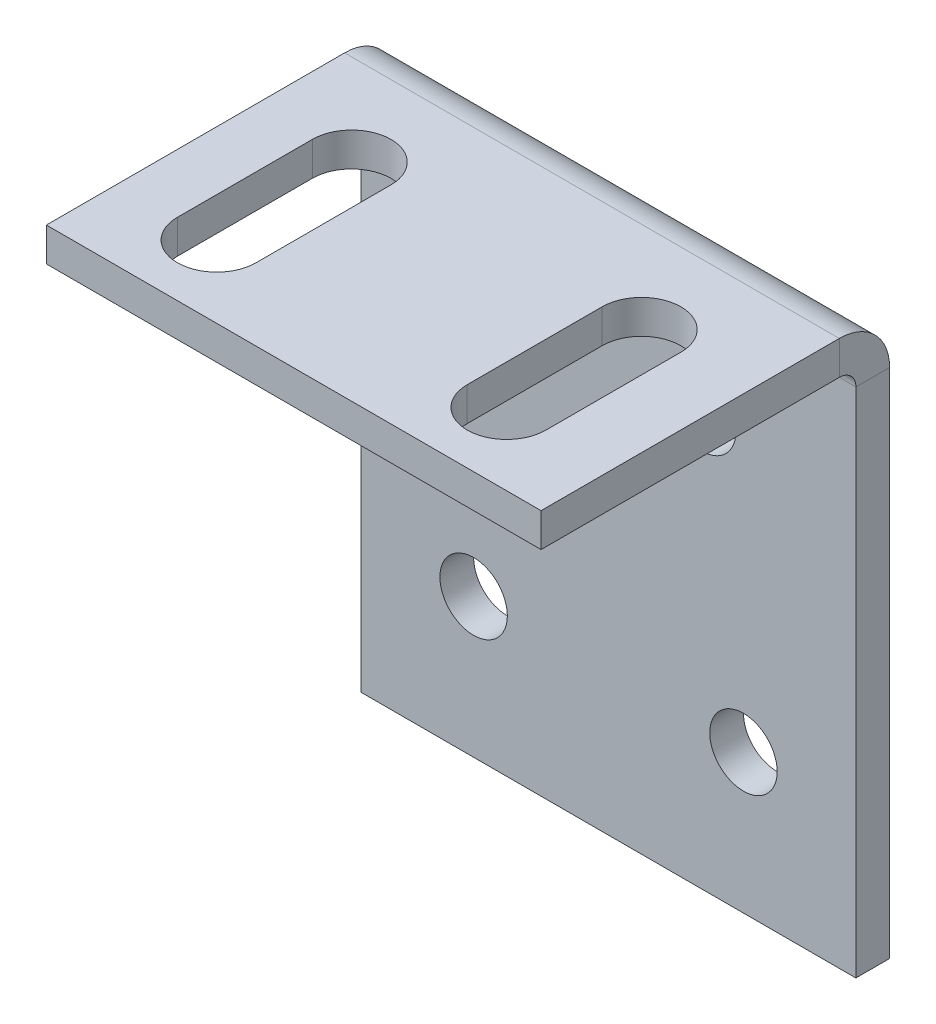
ISO-10303-21;
HEADER;
FILE_DESCRIPTION(('STEP AP214'),'2;1');
FILE_NAME('part.step','',(''),(''),'','','');
FILE_SCHEMA(('AUTOMOTIVE_DESIGN { 1 0 10303 214 1 1 1 1 }'));
ENDSEC;
DATA;
#1=APPLICATION_CONTEXT('core data for automotive mechanical design processes');
#2=APPLICATION_PROTOCOL_DEFINITION('international standard','automotive_design',2000,#1);
#3=PRODUCT_CONTEXT('',#1,'mechanical');
#4=PRODUCT('Part','Part','',(#3));
#5=PRODUCT_RELATED_PRODUCT_CATEGORY('part','',(#4));
#6=PRODUCT_DEFINITION_FORMATION('','',#4);
#7=PRODUCT_DEFINITION_CONTEXT('part definition',#1,'design');
#8=PRODUCT_DEFINITION('design','',#6,#7);
#9=PRODUCT_DEFINITION_SHAPE('','',#8);
#10=(LENGTH_UNIT() NAMED_UNIT(*) SI_UNIT(.MILLI.,.METRE.));
#11=(NAMED_UNIT(*) PLANE_ANGLE_UNIT() SI_UNIT($,.RADIAN.));
#12=(NAMED_UNIT(*) SI_UNIT($,.STERADIAN.) SOLID_ANGLE_UNIT());
#13=UNCERTAINTY_MEASURE_WITH_UNIT(LENGTH_MEASURE(1.E-05),#10,'distance_accuracy_value','');
#14=(GEOMETRIC_REPRESENTATION_CONTEXT(3) GLOBAL_UNCERTAINTY_ASSIGNED_CONTEXT((#13)) GLOBAL_UNIT_ASSIGNED_CONTEXT((#10,
#11,#12)) REPRESENTATION_CONTEXT('',''));
#15=CARTESIAN_POINT('',(0.,0.,0.));
#16=DIRECTION('',(0.,0.,1.));
#17=DIRECTION('',(1.,0.,0.));
#18=AXIS2_PLACEMENT_3D('',#15,#16,#17);
#19=CARTESIAN_POINT('',(-10.1655172413793,4.96896551724138,-1.5));
#20=DIRECTION('',(-1.,0.,0.));
#21=DIRECTION('',(0.,-1.,0.));
#22=AXIS2_PLACEMENT_3D('',#19,#20,#21);
#23=PLANE('',#22);
#24=DIRECTION('',(0.,-1.,0.));
#25=VECTOR('',#24,1.);
#26=CARTESIAN_POINT('',(-10.1655172413793,4.96896551724138,0.));
#27=LINE('',#26,#25);
#28=CARTESIAN_POINT('',(-10.1655172413793,2.73236551724138,0.));
#29=VERTEX_POINT('',#28);
#30=CARTESIAN_POINT('',(-10.1655172413793,-20.0310344827586,0.));
#31=VERTEX_POINT('',#30);
#32=EDGE_CURVE('E291',#29,#31,#27,.T.);
#33=ORIENTED_EDGE('',*,*,#32,.F.);
#34=DIRECTION('',(0.,0.,-1.));
#35=VECTOR('',#34,1.);
#36=CARTESIAN_POINT('',(-10.1655172413793,2.73236551724138,0.));
#37=LINE('',#36,#35);
#38=CARTESIAN_POINT('',(-10.1655172413793,2.73236551724138,-1.5));
#39=VERTEX_POINT('',#38);
#40=EDGE_CURVE('E253',#29,#39,#37,.T.);
#41=ORIENTED_EDGE('',*,*,#40,.T.);
#42=DIRECTION('',(0.,-1.,0.));
#43=VECTOR('',#42,1.);
#44=CARTESIAN_POINT('',(-10.1655172413793,4.96896551724138,-1.5));
#45=LINE('',#44,#43);
#46=CARTESIAN_POINT('',(-10.1655172413793,-20.0310344827586,-1.5));
#47=VERTEX_POINT('',#46);
#48=EDGE_CURVE('E294',#39,#47,#45,.T.);
#49=ORIENTED_EDGE('',*,*,#48,.T.);
#50=DIRECTION('',(0.,0.,1.));
#51=VECTOR('',#50,1.);
#52=CARTESIAN_POINT('',(-10.1655172413793,-20.0310344827586,-1.5));
#53=LINE('',#52,#51);
#54=EDGE_CURVE('E303',#47,#31,#53,.T.);
#55=ORIENTED_EDGE('',*,*,#54,.T.);
#56=EDGE_LOOP('',(#33,#41,#49,#55));
#57=FACE_BOUND('',#56,.T.);
#58=ADVANCED_FACE('F57',(#57),#23,.T.);
#59=CARTESIAN_POINT('',(0.,0.,-1.5));
#60=DIRECTION('',(0.,0.,1.));
#61=DIRECTION('',(1.,0.,0.));
#62=AXIS2_PLACEMENT_3D('',#59,#60,#61);
#63=PLANE('',#62);
#64=CARTESIAN_POINT('',(6.8344827586207,-13.8348292830273,-1.5));
#65=DIRECTION('',(0.,0.,1.));
#66=DIRECTION('',(1.,0.,0.));
#67=AXIS2_PLACEMENT_3D('',#64,#65,#66);
#68=CIRCLE('',#67,1.5);
#69=CARTESIAN_POINT('',(8.3344827586207,-13.8348292830273,-1.5));
#70=VERTEX_POINT('',#69);
#71=EDGE_CURVE('E288',#70,#70,#68,.T.);
#72=ORIENTED_EDGE('',*,*,#71,.T.);
#73=EDGE_LOOP('',(#72));
#74=FACE_BOUND('',#73,.T.);
#75=CARTESIAN_POINT('',(-5.1655172413793,-13.8348292830273,-1.5));
#76=DIRECTION('',(0.,0.,1.));
#77=DIRECTION('',(1.,0.,0.));
#78=AXIS2_PLACEMENT_3D('',#75,#76,#77);
#79=CIRCLE('',#78,1.5);
#80=CARTESIAN_POINT('',(-3.6655172413793,-13.8348292830273,-1.5));
#81=VERTEX_POINT('',#80);
#82=EDGE_CURVE('E282',#81,#81,#79,.T.);
#83=ORIENTED_EDGE('',*,*,#82,.T.);
#84=EDGE_LOOP('',(#83));
#85=FACE_BOUND('',#84,.T.);
#86=CARTESIAN_POINT('',(-3.4155172413793,-1.66280142120456,-1.5));
#87=DIRECTION('',(0.,0.,1.));
#88=DIRECTION('',(1.,0.,0.));
#89=AXIS2_PLACEMENT_3D('',#86,#87,#88);
#90=CIRCLE('',#89,1.5);
#91=CARTESIAN_POINT('',(-1.9155172413793,-1.66280142120456,-1.5));
#92=VERTEX_POINT('',#91);
#93=EDGE_CURVE('E276',#92,#92,#90,.T.);
#94=ORIENTED_EDGE('',*,*,#93,.T.);
#95=EDGE_LOOP('',(#94));
#96=FACE_BOUND('',#95,.T.);
#97=CARTESIAN_POINT('',(4.9944827586207,-1.66280142120456,-1.5));
#98=DIRECTION('',(0.,0.,1.));
#99=DIRECTION('',(1.,0.,0.));
#100=AXIS2_PLACEMENT_3D('',#97,#98,#99);
#101=CIRCLE('',#100,1.5);
#102=CARTESIAN_POINT('',(6.4944827586207,-1.66280142120456,-1.5));
#103=VERTEX_POINT('',#102);
#104=EDGE_CURVE('E270',#103,#103,#101,.T.);
#105=ORIENTED_EDGE('',*,*,#104,.T.);
#106=EDGE_LOOP('',(#105));
#107=FACE_BOUND('',#106,.T.);
#108=DIRECTION('',(-1.,0.,0.));
#109=VECTOR('',#108,1.);
#110=CARTESIAN_POINT('',(-10.1655172413793,2.73236551724138,-1.5));
#111=LINE('',#110,#109);
#112=CARTESIAN_POINT('',(11.8344827586207,2.73236551724139,-1.5));
#113=VERTEX_POINT('',#112);
#114=EDGE_CURVE('E247',#39,#113,#111,.F.);
#115=ORIENTED_EDGE('',*,*,#114,.T.);
#116=DIRECTION('',(0.,1.,0.));
#117=VECTOR('',#116,1.);
#118=CARTESIAN_POINT('',(11.8344827586207,4.96896551724138,-1.5));
#119=LINE('',#118,#117);
#120=CARTESIAN_POINT('',(11.8344827586207,-20.0310344827586,-1.5));
#121=VERTEX_POINT('',#120);
#122=EDGE_CURVE('E300',#121,#113,#119,.T.);
#123=ORIENTED_EDGE('',*,*,#122,.F.);
#124=DIRECTION('',(1.,0.,0.));
#125=VECTOR('',#124,1.);
#126=CARTESIAN_POINT('',(-10.1655172413793,-20.0310344827586,-1.5));
#127=LINE('',#126,#125);
#128=EDGE_CURVE('E296',#47,#121,#127,.T.);
#129=ORIENTED_EDGE('',*,*,#128,.F.);
#130=ORIENTED_EDGE('',*,*,#48,.F.);
#131=EDGE_LOOP('',(#115,#123,#129,#130));
#132=FACE_BOUND('',#131,.T.);
#133=ADVANCED_FACE('F348',(#74,#85,#96,#107,#132),#63,.F.);
#134=CARTESIAN_POINT('',(0.,0.,0.));
#135=DIRECTION('',(0.,0.,1.));
#136=DIRECTION('',(1.,0.,0.));
#137=AXIS2_PLACEMENT_3D('',#134,#135,#136);
#138=PLANE('',#137);
#139=CARTESIAN_POINT('',(4.9944827586207,-1.66280142120456,0.));
#140=DIRECTION('',(0.,0.,1.));
#141=DIRECTION('',(1.,0.,0.));
#142=AXIS2_PLACEMENT_3D('',#139,#140,#141);
#143=CIRCLE('',#142,1.5);
#144=CARTESIAN_POINT('',(6.4944827586207,-1.66280142120456,0.));
#145=VERTEX_POINT('',#144);
#146=EDGE_CURVE('E267',#145,#145,#143,.T.);
#147=ORIENTED_EDGE('',*,*,#146,.F.);
#148=EDGE_LOOP('',(#147));
#149=FACE_BOUND('',#148,.T.);
#150=CARTESIAN_POINT('',(-3.4155172413793,-1.66280142120456,0.));
#151=DIRECTION('',(0.,0.,1.));
#152=DIRECTION('',(1.,0.,0.));
#153=AXIS2_PLACEMENT_3D('',#150,#151,#152);
#154=CIRCLE('',#153,1.5);
#155=CARTESIAN_POINT('',(-1.9155172413793,-1.66280142120456,0.));
#156=VERTEX_POINT('',#155);
#157=EDGE_CURVE('E273',#156,#156,#154,.T.);
#158=ORIENTED_EDGE('',*,*,#157,.F.);
#159=EDGE_LOOP('',(#158));
#160=FACE_BOUND('',#159,.T.);
#161=CARTESIAN_POINT('',(-5.1655172413793,-13.8348292830273,0.));
#162=DIRECTION('',(0.,0.,1.));
#163=DIRECTION('',(1.,0.,0.));
#164=AXIS2_PLACEMENT_3D('',#161,#162,#163);
#165=CIRCLE('',#164,1.5);
#166=CARTESIAN_POINT('',(-3.6655172413793,-13.8348292830273,0.));
#167=VERTEX_POINT('',#166);
#168=EDGE_CURVE('E279',#167,#167,#165,.T.);
#169=ORIENTED_EDGE('',*,*,#168,.F.);
#170=EDGE_LOOP('',(#169));
#171=FACE_BOUND('',#170,.T.);
#172=CARTESIAN_POINT('',(6.8344827586207,-13.8348292830273,0.));
#173=DIRECTION('',(0.,0.,1.));
#174=DIRECTION('',(1.,0.,0.));
#175=AXIS2_PLACEMENT_3D('',#172,#173,#174);
#176=CIRCLE('',#175,1.5);
#177=CARTESIAN_POINT('',(8.3344827586207,-13.8348292830273,0.));
#178=VERTEX_POINT('',#177);
#179=EDGE_CURVE('E285',#178,#178,#176,.T.);
#180=ORIENTED_EDGE('',*,*,#179,.F.);
#181=EDGE_LOOP('',(#180));
#182=FACE_BOUND('',#181,.T.);
#183=DIRECTION('',(0.,1.,0.));
#184=VECTOR('',#183,1.);
#185=CARTESIAN_POINT('',(11.8344827586207,4.96896551724138,0.));
#186=LINE('',#185,#184);
#187=CARTESIAN_POINT('',(11.8344827586207,-20.0310344827586,0.));
#188=VERTEX_POINT('',#187);
#189=CARTESIAN_POINT('',(11.8344827586207,2.73236551724138,0.));
#190=VERTEX_POINT('',#189);
#191=EDGE_CURVE('E297',#188,#190,#186,.T.);
#192=ORIENTED_EDGE('',*,*,#191,.T.);
#193=DIRECTION('',(-1.,0.,0.));
#194=VECTOR('',#193,1.);
#195=CARTESIAN_POINT('',(-10.1655172413793,2.73236551724138,0.));
#196=LINE('',#195,#194);
#197=EDGE_CURVE('E259',#29,#190,#196,.F.);
#198=ORIENTED_EDGE('',*,*,#197,.F.);
#199=ORIENTED_EDGE('',*,*,#32,.T.);
#200=DIRECTION('',(1.,0.,0.));
#201=VECTOR('',#200,1.);
#202=CARTESIAN_POINT('',(-10.1655172413793,-20.0310344827586,0.));
#203=LINE('',#202,#201);
#204=EDGE_CURVE('E305',#31,#188,#203,.T.);
#205=ORIENTED_EDGE('',*,*,#204,.T.);
#206=EDGE_LOOP('',(#192,#198,#199,#205));
#207=FACE_BOUND('',#206,.T.);
#208=ADVANCED_FACE('F353',(#149,#160,#171,#182,#207),#138,.T.);
#209=CARTESIAN_POINT('',(11.8344827586207,4.96896551724138,-1.5));
#210=DIRECTION('',(1.,0.,0.));
#211=DIRECTION('',(0.,1.,0.));
#212=AXIS2_PLACEMENT_3D('',#209,#210,#211);
#213=PLANE('',#212);
#214=DIRECTION('',(0.,0.,-1.));
#215=VECTOR('',#214,1.);
#216=CARTESIAN_POINT('',(11.8344827586207,2.73236551724138,0.));
#217=LINE('',#216,#215);
#218=EDGE_CURVE('E264',#190,#113,#217,.T.);
#219=ORIENTED_EDGE('',*,*,#218,.F.);
#220=ORIENTED_EDGE('',*,*,#191,.F.);
#221=DIRECTION('',(0.,0.,1.));
#222=VECTOR('',#221,1.);
#223=CARTESIAN_POINT('',(11.8344827586207,-20.0310344827586,-1.5));
#224=LINE('',#223,#222);
#225=EDGE_CURVE('E310',#121,#188,#224,.T.);
#226=ORIENTED_EDGE('',*,*,#225,.F.);
#227=ORIENTED_EDGE('',*,*,#122,.T.);
#228=EDGE_LOOP('',(#219,#220,#226,#227));
#229=FACE_BOUND('',#228,.T.);
#230=ADVANCED_FACE('F394',(#229),#213,.T.);
#231=CARTESIAN_POINT('',(-10.1655172413793,-20.0310344827586,-1.5));
#232=DIRECTION('',(0.,-1.,0.));
#233=DIRECTION('',(0.,0.,-1.));
#234=AXIS2_PLACEMENT_3D('',#231,#232,#233);
#235=PLANE('',#234);
#236=ORIENTED_EDGE('',*,*,#204,.F.);
#237=ORIENTED_EDGE('',*,*,#54,.F.);
#238=ORIENTED_EDGE('',*,*,#128,.T.);
#239=ORIENTED_EDGE('',*,*,#225,.T.);
#240=EDGE_LOOP('',(#236,#237,#238,#239));
#241=FACE_BOUND('',#240,.T.);
#242=ADVANCED_FACE('F397',(#241),#235,.T.);
#243=CARTESIAN_POINT('',(6.8344827586207,-13.8348292830273,-1.5));
#244=DIRECTION('',(0.,0.,1.));
#245=DIRECTION('',(1.,0.,0.));
#246=AXIS2_PLACEMENT_3D('',#243,#244,#245);
#247=CYLINDRICAL_SURFACE('',#246,1.5);
#248=ORIENTED_EDGE('',*,*,#71,.F.);
#249=EDGE_LOOP('',(#248));
#250=FACE_BOUND('',#249,.T.);
#251=ORIENTED_EDGE('',*,*,#179,.T.);
#252=EDGE_LOOP('',(#251));
#253=FACE_BOUND('',#252,.T.);
#254=ADVANCED_FACE('F401',(#250,#253),#247,.F.);
#255=CARTESIAN_POINT('',(-5.1655172413793,-13.8348292830273,-1.5));
#256=DIRECTION('',(0.,0.,1.));
#257=DIRECTION('',(1.,0.,0.));
#258=AXIS2_PLACEMENT_3D('',#255,#256,#257);
#259=CYLINDRICAL_SURFACE('',#258,1.5);
#260=ORIENTED_EDGE('',*,*,#82,.F.);
#261=EDGE_LOOP('',(#260));
#262=FACE_BOUND('',#261,.T.);
#263=ORIENTED_EDGE('',*,*,#168,.T.);
#264=EDGE_LOOP('',(#263));
#265=FACE_BOUND('',#264,.T.);
#266=ADVANCED_FACE('F406',(#262,#265),#259,.F.);
#267=CARTESIAN_POINT('',(-3.4155172413793,-1.66280142120456,-1.5));
#268=DIRECTION('',(0.,0.,1.));
#269=DIRECTION('',(1.,0.,0.));
#270=AXIS2_PLACEMENT_3D('',#267,#268,#269);
#271=CYLINDRICAL_SURFACE('',#270,1.5);
#272=ORIENTED_EDGE('',*,*,#93,.F.);
#273=EDGE_LOOP('',(#272));
#274=FACE_BOUND('',#273,.T.);
#275=ORIENTED_EDGE('',*,*,#157,.T.);
#276=EDGE_LOOP('',(#275));
#277=FACE_BOUND('',#276,.T.);
#278=ADVANCED_FACE('F416',(#274,#277),#271,.F.);
#279=CARTESIAN_POINT('',(4.9944827586207,-1.66280142120456,-1.5));
#280=DIRECTION('',(0.,0.,1.));
#281=DIRECTION('',(1.,0.,0.));
#282=AXIS2_PLACEMENT_3D('',#279,#280,#281);
#283=CYLINDRICAL_SURFACE('',#282,1.5);
#284=ORIENTED_EDGE('',*,*,#104,.F.);
#285=EDGE_LOOP('',(#284));
#286=FACE_BOUND('',#285,.T.);
#287=ORIENTED_EDGE('',*,*,#146,.T.);
#288=EDGE_LOOP('',(#287));
#289=FACE_BOUND('',#288,.T.);
#290=ADVANCED_FACE('F420',(#286,#289),#283,.F.);
#291=CARTESIAN_POINT('',(11.8344827586207,2.73236551724138,0.7366));
#292=DIRECTION('',(1.,0.,0.));
#293=DIRECTION('',(0.,0.,-1.));
#294=AXIS2_PLACEMENT_3D('',#291,#292,#293);
#295=PLANE('',#294);
#296=DIRECTION('',(0.,-1.,0.));
#297=VECTOR('',#296,1.);
#298=CARTESIAN_POINT('',(11.8344827586207,4.96896551724138,0.736599999999992));
#299=LINE('',#298,#297);
#300=CARTESIAN_POINT('',(11.8344827586207,3.46896551724138,0.736599999999997));
#301=VERTEX_POINT('',#300);
#302=CARTESIAN_POINT('',(11.8344827586207,4.96896551724138,0.736599999999992));
#303=VERTEX_POINT('',#302);
#304=EDGE_CURVE('E210',#301,#303,#299,.F.);
#305=ORIENTED_EDGE('',*,*,#304,.F.);
#306=CARTESIAN_POINT('',(11.8344827586207,2.73236551724138,0.7366));
#307=DIRECTION('',(-1.,0.,0.));
#308=DIRECTION('',(0.,0.,1.));
#309=AXIS2_PLACEMENT_3D('',#306,#307,#308);
#310=CIRCLE('',#309,0.7366);
#311=EDGE_CURVE('E256',#190,#301,#310,.F.);
#312=ORIENTED_EDGE('',*,*,#311,.F.);
#313=ORIENTED_EDGE('',*,*,#218,.T.);
#314=CARTESIAN_POINT('',(11.8344827586207,2.73236551724138,0.7366));
#315=DIRECTION('',(-1.,0.,0.));
#316=DIRECTION('',(0.,0.,1.));
#317=AXIS2_PLACEMENT_3D('',#314,#315,#316);
#318=CIRCLE('',#317,2.2366);
#319=EDGE_CURVE('E249',#113,#303,#318,.F.);
#320=ORIENTED_EDGE('',*,*,#319,.T.);
#321=EDGE_LOOP('',(#305,#312,#313,#320));
#322=FACE_BOUND('',#321,.T.);
#323=ADVANCED_FACE('F391',(#322),#295,.T.);
#324=CARTESIAN_POINT('',(-10.1655172413793,2.73236551724138,0.736600000000001));
#325=DIRECTION('',(1.,0.,0.));
#326=DIRECTION('',(0.,0.,-1.));
#327=AXIS2_PLACEMENT_3D('',#324,#325,#326);
#328=PLANE('',#327);
#329=CARTESIAN_POINT('',(-10.1655172413793,2.73236551724138,0.736600000000001));
#330=DIRECTION('',(-1.,0.,0.));
#331=DIRECTION('',(0.,0.,1.));
#332=AXIS2_PLACEMENT_3D('',#329,#330,#331);
#333=CIRCLE('',#332,0.7366);
#334=CARTESIAN_POINT('',(-10.1655172413793,3.46896551724138,0.736599999999999));
#335=VERTEX_POINT('',#334);
#336=EDGE_CURVE('E220',#335,#29,#333,.T.);
#337=ORIENTED_EDGE('',*,*,#336,.F.);
#338=DIRECTION('',(0.,-1.,0.));
#339=VECTOR('',#338,1.);
#340=CARTESIAN_POINT('',(-10.1655172413793,3.46896551724138,0.736599999999999));
#341=LINE('',#340,#339);
#342=CARTESIAN_POINT('',(-10.1655172413793,4.96896551724138,0.736599999999993));
#343=VERTEX_POINT('',#342);
#344=EDGE_CURVE('E240',#335,#343,#341,.F.);
#345=ORIENTED_EDGE('',*,*,#344,.T.);
#346=CARTESIAN_POINT('',(-10.1655172413793,2.73236551724138,0.736600000000001));
#347=DIRECTION('',(-1.,0.,0.));
#348=DIRECTION('',(0.,0.,1.));
#349=AXIS2_PLACEMENT_3D('',#346,#347,#348);
#350=CIRCLE('',#349,2.2366);
#351=EDGE_CURVE('E250',#343,#39,#350,.T.);
#352=ORIENTED_EDGE('',*,*,#351,.T.);
#353=ORIENTED_EDGE('',*,*,#40,.F.);
#354=EDGE_LOOP('',(#337,#345,#352,#353));
#355=FACE_BOUND('',#354,.T.);
#356=ADVANCED_FACE('F364',(#355),#328,.F.);
#357=CARTESIAN_POINT('',(-10.1655172413793,2.73236551724138,0.736600000000001));
#358=DIRECTION('',(-1.,0.,0.));
#359=DIRECTION('',(0.,1.,0.));
#360=AXIS2_PLACEMENT_3D('',#357,#358,#359);
#361=CYLINDRICAL_SURFACE('',#360,2.2366);
#362=ORIENTED_EDGE('',*,*,#114,.F.);
#363=ORIENTED_EDGE('',*,*,#351,.F.);
#364=DIRECTION('',(-1.,0.,0.));
#365=VECTOR('',#364,1.);
#366=CARTESIAN_POINT('',(11.8344827586207,4.96896551724138,0.736599999999992));
#367=LINE('',#366,#365);
#368=EDGE_CURVE('E238',#343,#303,#367,.F.);
#369=ORIENTED_EDGE('',*,*,#368,.T.);
#370=ORIENTED_EDGE('',*,*,#319,.F.);
#371=EDGE_LOOP('',(#362,#363,#369,#370));
#372=FACE_BOUND('',#371,.T.);
#373=ADVANCED_FACE('F389',(#372),#361,.T.);
#374=CARTESIAN_POINT('',(-10.1655172413793,2.73236551724138,0.736600000000001));
#375=DIRECTION('',(-1.,0.,0.));
#376=DIRECTION('',(0.,1.,0.));
#377=AXIS2_PLACEMENT_3D('',#374,#375,#376);
#378=CYLINDRICAL_SURFACE('',#377,0.7366);
#379=ORIENTED_EDGE('',*,*,#197,.T.);
#380=ORIENTED_EDGE('',*,*,#311,.T.);
#381=DIRECTION('',(-1.,0.,0.));
#382=VECTOR('',#381,1.);
#383=CARTESIAN_POINT('',(11.8344827586207,3.46896551724138,0.736599999999997));
#384=LINE('',#383,#382);
#385=EDGE_CURVE('E243',#301,#335,#384,.T.);
#386=ORIENTED_EDGE('',*,*,#385,.T.);
#387=ORIENTED_EDGE('',*,*,#336,.T.);
#388=EDGE_LOOP('',(#379,#380,#386,#387));
#389=FACE_BOUND('',#388,.T.);
#390=ADVANCED_FACE('F367',(#389),#378,.F.);
#391=CARTESIAN_POINT('',(11.8344827586207,4.96896551724138,0.));
#392=DIRECTION('',(-1.,0.,0.));
#393=DIRECTION('',(0.,0.,1.));
#394=AXIS2_PLACEMENT_3D('',#391,#392,#393);
#395=PLANE('',#394);
#396=ORIENTED_EDGE('',*,*,#304,.T.);
#397=DIRECTION('',(0.,0.,-1.));
#398=VECTOR('',#397,1.);
#399=CARTESIAN_POINT('',(11.8344827586207,4.96896551724138,0.));
#400=LINE('',#399,#398);
#401=CARTESIAN_POINT('',(11.8344827586207,4.96896551724143,14.));
#402=VERTEX_POINT('',#401);
#403=EDGE_CURVE('E228',#402,#303,#400,.T.);
#404=ORIENTED_EDGE('',*,*,#403,.F.);
#405=DIRECTION('',(0.,-1.,0.));
#406=VECTOR('',#405,1.);
#407=CARTESIAN_POINT('',(11.8344827586207,4.96896551724143,14.));
#408=LINE('',#407,#406);
#409=CARTESIAN_POINT('',(11.8344827586207,3.46896551724143,14.));
#410=VERTEX_POINT('',#409);
#411=EDGE_CURVE('E221',#402,#410,#408,.T.);
#412=ORIENTED_EDGE('',*,*,#411,.T.);
#413=DIRECTION('',(0.,0.,1.));
#414=VECTOR('',#413,1.);
#415=CARTESIAN_POINT('',(11.8344827586207,3.46896551724138,0.));
#416=LINE('',#415,#414);
#417=EDGE_CURVE('E235',#410,#301,#416,.F.);
#418=ORIENTED_EDGE('',*,*,#417,.T.);
#419=EDGE_LOOP('',(#396,#404,#412,#418));
#420=FACE_BOUND('',#419,.T.);
#421=ADVANCED_FACE('F375',(#420),#395,.F.);
#422=CARTESIAN_POINT('',(-10.1655172413793,4.96896551724143,14.));
#423=DIRECTION('',(1.,0.,0.));
#424=DIRECTION('',(0.,0.,-1.));
#425=AXIS2_PLACEMENT_3D('',#422,#423,#424);
#426=PLANE('',#425);
#427=ORIENTED_EDGE('',*,*,#344,.F.);
#428=DIRECTION('',(0.,0.,-1.));
#429=VECTOR('',#428,1.);
#430=CARTESIAN_POINT('',(-10.1655172413793,3.46896551724143,14.));
#431=LINE('',#430,#429);
#432=CARTESIAN_POINT('',(-10.1655172413793,3.46896551724143,14.));
#433=VERTEX_POINT('',#432);
#434=EDGE_CURVE('E233',#335,#433,#431,.F.);
#435=ORIENTED_EDGE('',*,*,#434,.T.);
#436=DIRECTION('',(0.,-1.,0.));
#437=VECTOR('',#436,1.);
#438=CARTESIAN_POINT('',(-10.1655172413793,4.96896551724143,14.));
#439=LINE('',#438,#437);
#440=CARTESIAN_POINT('',(-10.1655172413793,4.96896551724143,14.));
#441=VERTEX_POINT('',#440);
#442=EDGE_CURVE('E217',#441,#433,#439,.T.);
#443=ORIENTED_EDGE('',*,*,#442,.F.);
#444=DIRECTION('',(0.,0.,1.));
#445=VECTOR('',#444,1.);
#446=CARTESIAN_POINT('',(-10.1655172413793,4.96896551724138,0.));
#447=LINE('',#446,#445);
#448=EDGE_CURVE('E226',#343,#441,#447,.T.);
#449=ORIENTED_EDGE('',*,*,#448,.F.);
#450=EDGE_LOOP('',(#427,#435,#443,#449));
#451=FACE_BOUND('',#450,.T.);
#452=ADVANCED_FACE('F384',(#451),#426,.F.);
#453=CARTESIAN_POINT('',(0.,4.96896551724138,0.));
#454=DIRECTION('',(0.,-1.,0.));
#455=DIRECTION('',(0.,0.,-1.));
#456=AXIS2_PLACEMENT_3D('',#453,#454,#455);
#457=PLANE('',#456);
#458=DIRECTION('',(0.,0.,-1.));
#459=VECTOR('',#458,1.);
#460=CARTESIAN_POINT('',(8.84053100399615,4.96896551724142,10.7894952077032));
#461=LINE('',#460,#459);
#462=CARTESIAN_POINT('',(8.84053100399615,4.96896551724142,10.7894952077032));
#463=VERTEX_POINT('',#462);
#464=CARTESIAN_POINT('',(8.84053100399615,4.9689655172414,4.78949520770321));
#465=VERTEX_POINT('',#464);
#466=EDGE_CURVE('E180',#463,#465,#461,.T.);
#467=ORIENTED_EDGE('',*,*,#466,.F.);
#468=CARTESIAN_POINT('',(7.09053100399615,4.96896551724142,10.7894952077032));
#469=DIRECTION('',(0.,1.,0.));
#470=DIRECTION('',(0.,0.,1.));
#471=AXIS2_PLACEMENT_3D('',#468,#469,#470);
#472=CIRCLE('',#471,1.75);
#473=CARTESIAN_POINT('',(5.34053100399615,4.96896551724142,10.7894952077032));
#474=VERTEX_POINT('',#473);
#475=EDGE_CURVE('E71',#474,#463,#472,.T.);
#476=ORIENTED_EDGE('',*,*,#475,.F.);
#477=DIRECTION('',(0.,0.,1.));
#478=VECTOR('',#477,1.);
#479=CARTESIAN_POINT('',(5.34053100399615,4.96896551724142,10.7894952077032));
#480=LINE('',#479,#478);
#481=CARTESIAN_POINT('',(5.34053100399615,4.9689655172414,4.78949520770321));
#482=VERTEX_POINT('',#481);
#483=EDGE_CURVE('E187',#482,#474,#480,.T.);
#484=ORIENTED_EDGE('',*,*,#483,.F.);
#485=CARTESIAN_POINT('',(7.09053100399615,4.9689655172414,4.78949520770321));
#486=DIRECTION('',(0.,1.,0.));
#487=DIRECTION('',(0.,0.,1.));
#488=AXIS2_PLACEMENT_3D('',#485,#486,#487);
#489=CIRCLE('',#488,1.75);
#490=EDGE_CURVE('E171',#465,#482,#489,.T.);
#491=ORIENTED_EDGE('',*,*,#490,.F.);
#492=EDGE_LOOP('',(#467,#476,#484,#491));
#493=FACE_BOUND('',#492,.T.);
#494=DIRECTION('',(0.,0.,-1.));
#495=VECTOR('',#494,1.);
#496=CARTESIAN_POINT('',(-4.05074512829754,4.96896551724142,10.7894952077032));
#497=LINE('',#496,#495);
#498=CARTESIAN_POINT('',(-4.05074512829754,4.96896551724142,10.7894952077032));
#499=VERTEX_POINT('',#498);
#500=CARTESIAN_POINT('',(-4.05074512829754,4.9689655172414,4.78949520770321));
#501=VERTEX_POINT('',#500);
#502=EDGE_CURVE('E198',#499,#501,#497,.T.);
#503=ORIENTED_EDGE('',*,*,#502,.F.);
#504=CARTESIAN_POINT('',(-5.80074512829754,4.96896551724142,10.7894952077032));
#505=DIRECTION('',(0.,1.,0.));
#506=DIRECTION('',(0.,0.,1.));
#507=AXIS2_PLACEMENT_3D('',#504,#505,#506);
#508=CIRCLE('',#507,1.75);
#509=CARTESIAN_POINT('',(-7.55074512829754,4.96896551724142,10.7894952077032));
#510=VERTEX_POINT('',#509);
#511=EDGE_CURVE('E194',#510,#499,#508,.T.);
#512=ORIENTED_EDGE('',*,*,#511,.F.);
#513=DIRECTION('',(0.,0.,1.));
#514=VECTOR('',#513,1.);
#515=CARTESIAN_POINT('',(-7.55074512829754,4.96896551724142,10.7894952077032));
#516=LINE('',#515,#514);
#517=CARTESIAN_POINT('',(-7.55074512829754,4.9689655172414,4.78949520770321));
#518=VERTEX_POINT('',#517);
#519=EDGE_CURVE('E204',#518,#510,#516,.T.);
#520=ORIENTED_EDGE('',*,*,#519,.F.);
#521=CARTESIAN_POINT('',(-5.80074512829754,4.9689655172414,4.78949520770321));
#522=DIRECTION('',(0.,1.,0.));
#523=DIRECTION('',(0.,0.,1.));
#524=AXIS2_PLACEMENT_3D('',#521,#522,#523);
#525=CIRCLE('',#524,1.75);
#526=EDGE_CURVE('E201',#501,#518,#525,.T.);
#527=ORIENTED_EDGE('',*,*,#526,.F.);
#528=EDGE_LOOP('',(#503,#512,#520,#527));
#529=FACE_BOUND('',#528,.T.);
#530=ORIENTED_EDGE('',*,*,#368,.F.);
#531=ORIENTED_EDGE('',*,*,#448,.T.);
#532=DIRECTION('',(1.,0.,0.));
#533=VECTOR('',#532,1.);
#534=CARTESIAN_POINT('',(0.,4.96896551724143,14.));
#535=LINE('',#534,#533);
#536=EDGE_CURVE('E224',#441,#402,#535,.T.);
#537=ORIENTED_EDGE('',*,*,#536,.T.);
#538=ORIENTED_EDGE('',*,*,#403,.T.);
#539=EDGE_LOOP('',(#530,#531,#537,#538));
#540=FACE_BOUND('',#539,.T.);
#541=ADVANCED_FACE('F184',(#493,#529,#540),#457,.F.);
#542=CARTESIAN_POINT('',(0.,3.46896551724138,0.));
#543=DIRECTION('',(0.,-1.,0.));
#544=DIRECTION('',(0.,0.,-1.));
#545=AXIS2_PLACEMENT_3D('',#542,#543,#544);
#546=PLANE('',#545);
#547=CARTESIAN_POINT('',(7.09053100399615,3.46896551724142,10.7894952077032));
#548=DIRECTION('',(0.,-1.,0.));
#549=DIRECTION('',(0.,0.,-1.));
#550=AXIS2_PLACEMENT_3D('',#547,#548,#549);
#551=CIRCLE('',#550,1.75);
#552=CARTESIAN_POINT('',(8.84053100399615,3.46896551724141,10.7894952077032));
#553=VERTEX_POINT('',#552);
#554=CARTESIAN_POINT('',(5.34053100399615,3.46896551724141,10.7894952077032));
#555=VERTEX_POINT('',#554);
#556=EDGE_CURVE('E13',#553,#555,#551,.T.);
#557=ORIENTED_EDGE('',*,*,#556,.F.);
#558=DIRECTION('',(0.,0.,1.));
#559=VECTOR('',#558,1.);
#560=CARTESIAN_POINT('',(8.84053100399615,3.46896551724138,0.));
#561=LINE('',#560,#559);
#562=CARTESIAN_POINT('',(8.84053100399615,3.4689655172414,4.78949520770321));
#563=VERTEX_POINT('',#562);
#564=EDGE_CURVE('E323',#563,#553,#561,.T.);
#565=ORIENTED_EDGE('',*,*,#564,.F.);
#566=CARTESIAN_POINT('',(7.09053100399615,3.4689655172414,4.78949520770321));
#567=DIRECTION('',(0.,-1.,0.));
#568=DIRECTION('',(0.,0.,-1.));
#569=AXIS2_PLACEMENT_3D('',#566,#567,#568);
#570=CIRCLE('',#569,1.75);
#571=CARTESIAN_POINT('',(5.34053100399615,3.46896551724139,4.78949520770321));
#572=VERTEX_POINT('',#571);
#573=EDGE_CURVE('E174',#572,#563,#570,.T.);
#574=ORIENTED_EDGE('',*,*,#573,.F.);
#575=DIRECTION('',(0.,0.,-1.));
#576=VECTOR('',#575,1.);
#577=CARTESIAN_POINT('',(5.34053100399615,3.46896551724138,0.));
#578=LINE('',#577,#576);
#579=EDGE_CURVE('E64',#555,#572,#578,.T.);
#580=ORIENTED_EDGE('',*,*,#579,.F.);
#581=EDGE_LOOP('',(#557,#565,#574,#580));
#582=FACE_BOUND('',#581,.T.);
#583=CARTESIAN_POINT('',(-5.80074512829754,3.46896551724142,10.7894952077032));
#584=DIRECTION('',(0.,-1.,0.));
#585=DIRECTION('',(0.,0.,-1.));
#586=AXIS2_PLACEMENT_3D('',#583,#584,#585);
#587=CIRCLE('',#586,1.75);
#588=CARTESIAN_POINT('',(-4.05074512829754,3.46896551724141,10.7894952077032));
#589=VERTEX_POINT('',#588);
#590=CARTESIAN_POINT('',(-7.55074512829754,3.46896551724141,10.7894952077032));
#591=VERTEX_POINT('',#590);
#592=EDGE_CURVE('E321',#589,#591,#587,.T.);
#593=ORIENTED_EDGE('',*,*,#592,.F.);
#594=DIRECTION('',(0.,0.,1.));
#595=VECTOR('',#594,1.);
#596=CARTESIAN_POINT('',(-4.05074512829754,3.46896551724138,0.));
#597=LINE('',#596,#595);
#598=CARTESIAN_POINT('',(-4.05074512829754,3.4689655172414,4.78949520770321));
#599=VERTEX_POINT('',#598);
#600=EDGE_CURVE('E312',#599,#589,#597,.T.);
#601=ORIENTED_EDGE('',*,*,#600,.F.);
#602=CARTESIAN_POINT('',(-5.80074512829754,3.4689655172414,4.78949520770321));
#603=DIRECTION('',(0.,-1.,0.));
#604=DIRECTION('',(0.,0.,-1.));
#605=AXIS2_PLACEMENT_3D('',#602,#603,#604);
#606=CIRCLE('',#605,1.75);
#607=CARTESIAN_POINT('',(-7.55074512829754,3.46896551724139,4.78949520770321));
#608=VERTEX_POINT('',#607);
#609=EDGE_CURVE('E316',#608,#599,#606,.T.);
#610=ORIENTED_EDGE('',*,*,#609,.F.);
#611=DIRECTION('',(0.,0.,-1.));
#612=VECTOR('',#611,1.);
#613=CARTESIAN_POINT('',(-7.55074512829754,3.46896551724138,0.));
#614=LINE('',#613,#612);
#615=EDGE_CURVE('E319',#591,#608,#614,.T.);
#616=ORIENTED_EDGE('',*,*,#615,.F.);
#617=EDGE_LOOP('',(#593,#601,#610,#616));
#618=FACE_BOUND('',#617,.T.);
#619=ORIENTED_EDGE('',*,*,#434,.F.);
#620=ORIENTED_EDGE('',*,*,#385,.F.);
#621=ORIENTED_EDGE('',*,*,#417,.F.);
#622=DIRECTION('',(-1.,0.,0.));
#623=VECTOR('',#622,1.);
#624=CARTESIAN_POINT('',(11.8344827586207,3.46896551724143,14.));
#625=LINE('',#624,#623);
#626=EDGE_CURVE('E231',#433,#410,#625,.F.);
#627=ORIENTED_EDGE('',*,*,#626,.F.);
#628=EDGE_LOOP('',(#619,#620,#621,#627));
#629=FACE_BOUND('',#628,.T.);
#630=ADVANCED_FACE('F331',(#582,#618,#629),#546,.T.);
#631=CARTESIAN_POINT('',(11.8344827586207,4.96896551724143,14.));
#632=DIRECTION('',(0.,0.,-1.));
#633=DIRECTION('',(0.,1.,0.));
#634=AXIS2_PLACEMENT_3D('',#631,#632,#633);
#635=PLANE('',#634);
#636=ORIENTED_EDGE('',*,*,#626,.T.);
#637=ORIENTED_EDGE('',*,*,#411,.F.);
#638=ORIENTED_EDGE('',*,*,#536,.F.);
#639=ORIENTED_EDGE('',*,*,#442,.T.);
#640=EDGE_LOOP('',(#636,#637,#638,#639));
#641=FACE_BOUND('',#640,.T.);
#642=ADVANCED_FACE('F380',(#641),#635,.F.);
#643=CARTESIAN_POINT('',(-5.80074512829754,-5.03103448275858,10.7894952077032));
#644=DIRECTION('',(0.,1.,0.));
#645=DIRECTION('',(0.,0.,1.));
#646=AXIS2_PLACEMENT_3D('',#643,#644,#645);
#647=CYLINDRICAL_SURFACE('',#646,1.75);
#648=ORIENTED_EDGE('',*,*,#592,.T.);
#649=DIRECTION('',(0.,1.,0.));
#650=VECTOR('',#649,1.);
#651=CARTESIAN_POINT('',(-7.55074512829754,-5.03103448275858,10.7894952077032));
#652=LINE('',#651,#650);
#653=EDGE_CURVE('E208',#591,#510,#652,.T.);
#654=ORIENTED_EDGE('',*,*,#653,.T.);
#655=ORIENTED_EDGE('',*,*,#511,.T.);
#656=DIRECTION('',(0.,1.,0.));
#657=VECTOR('',#656,1.);
#658=CARTESIAN_POINT('',(-4.05074512829754,-5.03103448275858,10.7894952077032));
#659=LINE('',#658,#657);
#660=EDGE_CURVE('E207',#589,#499,#659,.T.);
#661=ORIENTED_EDGE('',*,*,#660,.F.);
#662=EDGE_LOOP('',(#648,#654,#655,#661));
#663=FACE_BOUND('',#662,.T.);
#664=ADVANCED_FACE('F439',(#663),#647,.F.);
#665=CARTESIAN_POINT('',(-7.55074512829754,-5.03103448275858,10.7894952077032));
#666=DIRECTION('',(-1.,0.,0.));
#667=DIRECTION('',(0.,0.,1.));
#668=AXIS2_PLACEMENT_3D('',#665,#666,#667);
#669=PLANE('',#668);
#670=ORIENTED_EDGE('',*,*,#615,.T.);
#671=DIRECTION('',(0.,1.,0.));
#672=VECTOR('',#671,1.);
#673=CARTESIAN_POINT('',(-7.55074512829754,-5.0310344827586,4.78949520770324));
#674=LINE('',#673,#672);
#675=EDGE_CURVE('E211',#608,#518,#674,.T.);
#676=ORIENTED_EDGE('',*,*,#675,.T.);
#677=ORIENTED_EDGE('',*,*,#519,.T.);
#678=ORIENTED_EDGE('',*,*,#653,.F.);
#679=EDGE_LOOP('',(#670,#676,#677,#678));
#680=FACE_BOUND('',#679,.T.);
#681=ADVANCED_FACE('F445',(#680),#669,.F.);
#682=CARTESIAN_POINT('',(-5.80074512829754,-5.0310344827586,4.78949520770324));
#683=DIRECTION('',(0.,1.,0.));
#684=DIRECTION('',(0.,0.,1.));
#685=AXIS2_PLACEMENT_3D('',#682,#683,#684);
#686=CYLINDRICAL_SURFACE('',#685,1.75);
#687=ORIENTED_EDGE('',*,*,#609,.T.);
#688=DIRECTION('',(0.,1.,0.));
#689=VECTOR('',#688,1.);
#690=CARTESIAN_POINT('',(-4.05074512829754,-5.0310344827586,4.78949520770324));
#691=LINE('',#690,#689);
#692=EDGE_CURVE('E213',#599,#501,#691,.T.);
#693=ORIENTED_EDGE('',*,*,#692,.T.);
#694=ORIENTED_EDGE('',*,*,#526,.T.);
#695=ORIENTED_EDGE('',*,*,#675,.F.);
#696=EDGE_LOOP('',(#687,#693,#694,#695));
#697=FACE_BOUND('',#696,.T.);
#698=ADVANCED_FACE('F342',(#697),#686,.F.);
#699=CARTESIAN_POINT('',(-4.05074512829754,-5.03103448275858,10.7894952077032));
#700=DIRECTION('',(1.,0.,0.));
#701=DIRECTION('',(0.,0.,-1.));
#702=AXIS2_PLACEMENT_3D('',#699,#700,#701);
#703=PLANE('',#702);
#704=ORIENTED_EDGE('',*,*,#600,.T.);
#705=ORIENTED_EDGE('',*,*,#660,.T.);
#706=ORIENTED_EDGE('',*,*,#502,.T.);
#707=ORIENTED_EDGE('',*,*,#692,.F.);
#708=EDGE_LOOP('',(#704,#705,#706,#707));
#709=FACE_BOUND('',#708,.T.);
#710=ADVANCED_FACE('F335',(#709),#703,.F.);
#711=CARTESIAN_POINT('',(7.09053100399615,-5.03103448275858,10.7894952077032));
#712=DIRECTION('',(0.,1.,0.));
#713=DIRECTION('',(0.,0.,1.));
#714=AXIS2_PLACEMENT_3D('',#711,#712,#713);
#715=CYLINDRICAL_SURFACE('',#714,1.75);
#716=ORIENTED_EDGE('',*,*,#556,.T.);
#717=DIRECTION('',(0.,1.,0.));
#718=VECTOR('',#717,1.);
#719=CARTESIAN_POINT('',(5.34053100399615,-5.03103448275858,10.7894952077032));
#720=LINE('',#719,#718);
#721=EDGE_CURVE('E192',#555,#474,#720,.T.);
#722=ORIENTED_EDGE('',*,*,#721,.T.);
#723=ORIENTED_EDGE('',*,*,#475,.T.);
#724=DIRECTION('',(0.,1.,0.));
#725=VECTOR('',#724,1.);
#726=CARTESIAN_POINT('',(8.84053100399615,-5.03103448275858,10.7894952077032));
#727=LINE('',#726,#725);
#728=EDGE_CURVE('E177',#553,#463,#727,.T.);
#729=ORIENTED_EDGE('',*,*,#728,.F.);
#730=EDGE_LOOP('',(#716,#722,#723,#729));
#731=FACE_BOUND('',#730,.T.);
#732=ADVANCED_FACE('F333',(#731),#715,.F.);
#733=CARTESIAN_POINT('',(5.34053100399615,-5.03103448275858,10.7894952077032));
#734=DIRECTION('',(-1.,0.,0.));
#735=DIRECTION('',(0.,0.,1.));
#736=AXIS2_PLACEMENT_3D('',#733,#734,#735);
#737=PLANE('',#736);
#738=ORIENTED_EDGE('',*,*,#579,.T.);
#739=DIRECTION('',(0.,1.,0.));
#740=VECTOR('',#739,1.);
#741=CARTESIAN_POINT('',(5.34053100399615,-5.0310344827586,4.78949520770324));
#742=LINE('',#741,#740);
#743=EDGE_CURVE('E176',#572,#482,#742,.T.);
#744=ORIENTED_EDGE('',*,*,#743,.T.);
#745=ORIENTED_EDGE('',*,*,#483,.T.);
#746=ORIENTED_EDGE('',*,*,#721,.F.);
#747=EDGE_LOOP('',(#738,#744,#745,#746));
#748=FACE_BOUND('',#747,.T.);
#749=ADVANCED_FACE('F328',(#748),#737,.F.);
#750=CARTESIAN_POINT('',(7.09053100399615,-5.0310344827586,4.78949520770324));
#751=DIRECTION('',(0.,1.,0.));
#752=DIRECTION('',(0.,0.,1.));
#753=AXIS2_PLACEMENT_3D('',#750,#751,#752);
#754=CYLINDRICAL_SURFACE('',#753,1.75);
#755=ORIENTED_EDGE('',*,*,#573,.T.);
#756=DIRECTION('',(0.,1.,0.));
#757=VECTOR('',#756,1.);
#758=CARTESIAN_POINT('',(8.84053100399615,-5.0310344827586,4.78949520770324));
#759=LINE('',#758,#757);
#760=EDGE_CURVE('E79',#563,#465,#759,.T.);
#761=ORIENTED_EDGE('',*,*,#760,.T.);
#762=ORIENTED_EDGE('',*,*,#490,.T.);
#763=ORIENTED_EDGE('',*,*,#743,.F.);
#764=EDGE_LOOP('',(#755,#761,#762,#763));
#765=FACE_BOUND('',#764,.T.);
#766=ADVANCED_FACE('F168',(#765),#754,.F.);
#767=CARTESIAN_POINT('',(8.84053100399615,-5.03103448275858,10.7894952077032));
#768=DIRECTION('',(1.,0.,0.));
#769=DIRECTION('',(0.,0.,-1.));
#770=AXIS2_PLACEMENT_3D('',#767,#768,#769);
#771=PLANE('',#770);
#772=ORIENTED_EDGE('',*,*,#564,.T.);
#773=ORIENTED_EDGE('',*,*,#728,.T.);
#774=ORIENTED_EDGE('',*,*,#466,.T.);
#775=ORIENTED_EDGE('',*,*,#760,.F.);
#776=EDGE_LOOP('',(#772,#773,#774,#775));
#777=FACE_BOUND('',#776,.T.);
#778=ADVANCED_FACE('F181',(#777),#771,.F.);
#779=CLOSED_SHELL('',(#58,#133,#208,#230,#242,#254,#266,#278,#290,#323,#356,#373,#390,#421,#452,
#541,#630,#642,#664,#681,#698,#710,#732,#749,#766,#778));
#780=MANIFOLD_SOLID_BREP('B2',#779);
#781=ADVANCED_BREP_SHAPE_REPRESENTATION('',(#18,#780),#14);
#782=SHAPE_DEFINITION_REPRESENTATION(#9,#781);
ENDSEC;
END-ISO-10303-21;
